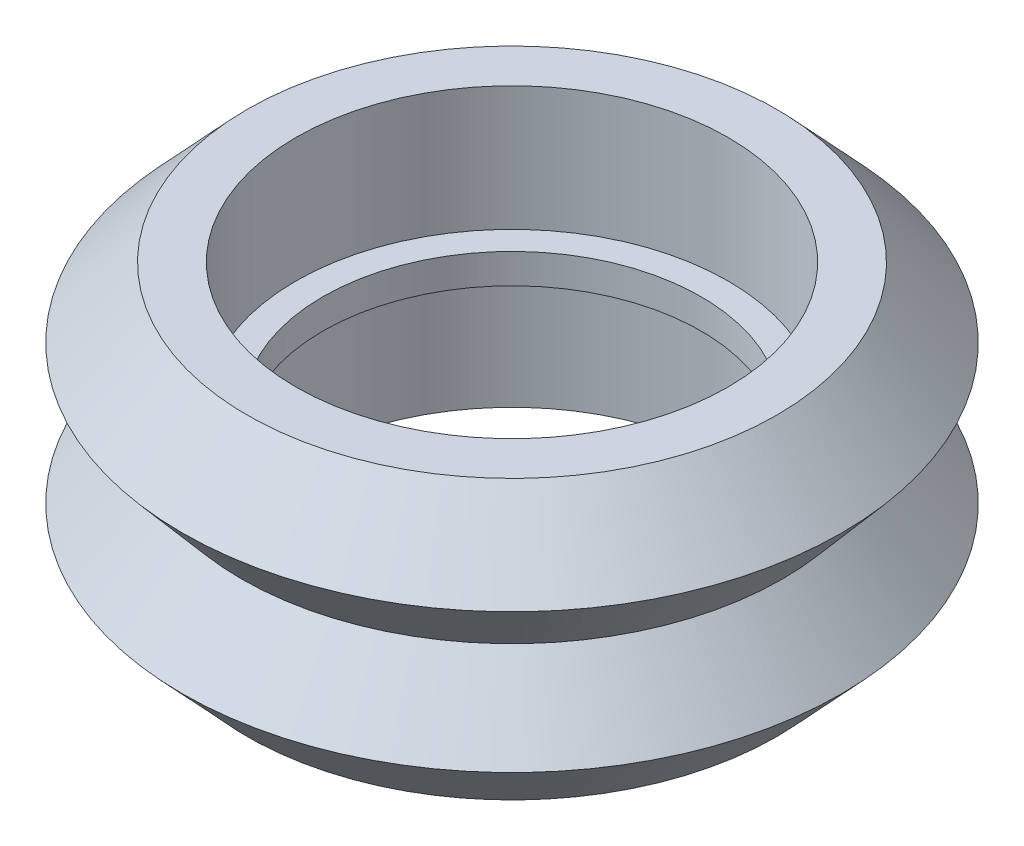
ISO-10303-21;
HEADER;
FILE_DESCRIPTION(('STEP AP214'),'2;1');
FILE_NAME('part.step','',(''),(''),'','','');
FILE_SCHEMA(('AUTOMOTIVE_DESIGN { 1 0 10303 214 1 1 1 1 }'));
ENDSEC;
DATA;
#1=APPLICATION_CONTEXT('core data for automotive mechanical design processes');
#2=APPLICATION_PROTOCOL_DEFINITION('international standard','automotive_design',2000,#1);
#3=PRODUCT_CONTEXT('',#1,'mechanical');
#4=PRODUCT('Part','Part','',(#3));
#5=PRODUCT_RELATED_PRODUCT_CATEGORY('part','',(#4));
#6=PRODUCT_DEFINITION_FORMATION('','',#4);
#7=PRODUCT_DEFINITION_CONTEXT('part definition',#1,'design');
#8=PRODUCT_DEFINITION('design','',#6,#7);
#9=PRODUCT_DEFINITION_SHAPE('','',#8);
#10=(LENGTH_UNIT() NAMED_UNIT(*) SI_UNIT(.MILLI.,.METRE.));
#11=(NAMED_UNIT(*) PLANE_ANGLE_UNIT() SI_UNIT($,.RADIAN.));
#12=(NAMED_UNIT(*) SI_UNIT($,.STERADIAN.) SOLID_ANGLE_UNIT());
#13=UNCERTAINTY_MEASURE_WITH_UNIT(LENGTH_MEASURE(1.E-05),#10,'distance_accuracy_value','');
#14=(GEOMETRIC_REPRESENTATION_CONTEXT(3) GLOBAL_UNCERTAINTY_ASSIGNED_CONTEXT((#13)) GLOBAL_UNIT_ASSIGNED_CONTEXT((#10,
#11,#12)) REPRESENTATION_CONTEXT('',''));
#15=CARTESIAN_POINT('',(0.,0.,0.));
#16=DIRECTION('',(0.,0.,1.));
#17=DIRECTION('',(1.,0.,0.));
#18=AXIS2_PLACEMENT_3D('',#15,#16,#17);
#19=CARTESIAN_POINT('',(6.77329391317618,2.75971763161515,-0.987652433195763));
#20=DIRECTION('',(0.,1.,0.));
#21=DIRECTION('',(1.,0.,0.));
#22=AXIS2_PLACEMENT_3D('',#19,#20,#21);
#23=PLANE('',#22);
#24=CARTESIAN_POINT('',(-1.22170608682382,2.75971763161515,-0.987652433195763));
#25=DIRECTION('',(0.,-1.,0.));
#26=DIRECTION('',(1.,0.,0.));
#27=AXIS2_PLACEMENT_3D('',#24,#25,#26);
#28=CIRCLE('',#27,7.995);
#29=CARTESIAN_POINT('',(6.77329391317618,2.75971763161515,-0.987652433195763));
#30=VERTEX_POINT('',#29);
#31=CARTESIAN_POINT('',(-9.21670608682382,2.75971763161515,-0.987652433195764));
#32=VERTEX_POINT('',#31);
#33=EDGE_CURVE('E39',#30,#32,#28,.T.);
#34=ORIENTED_EDGE('',*,*,#33,.F.);
#35=CARTESIAN_POINT('',(-1.22170608682382,2.75971763161515,-0.987652433195763));
#36=DIRECTION('',(0.,-1.,0.));
#37=DIRECTION('',(1.,0.,0.));
#38=AXIS2_PLACEMENT_3D('',#35,#36,#37);
#39=CIRCLE('',#38,7.995);
#40=EDGE_CURVE('E153',#32,#30,#39,.T.);
#41=ORIENTED_EDGE('',*,*,#40,.F.);
#42=EDGE_LOOP('',(#34,#41));
#43=FACE_BOUND('',#42,.T.);
#44=CARTESIAN_POINT('',(-1.22170608682382,2.75971763161515,-0.987652433195763));
#45=DIRECTION('',(0.,-1.,0.));
#46=DIRECTION('',(1.,0.,0.));
#47=AXIS2_PLACEMENT_3D('',#44,#45,#46);
#48=CIRCLE('',#47,6.995);
#49=CARTESIAN_POINT('',(5.77329391317618,2.75971763161515,-0.987652433195763));
#50=VERTEX_POINT('',#49);
#51=CARTESIAN_POINT('',(-8.21670608682382,2.75971763161515,-0.987652433195763));
#52=VERTEX_POINT('',#51);
#53=EDGE_CURVE('E10',#50,#52,#48,.T.);
#54=ORIENTED_EDGE('',*,*,#53,.T.);
#55=CARTESIAN_POINT('',(-1.22170608682382,2.75971763161515,-0.987652433195763));
#56=DIRECTION('',(0.,-1.,0.));
#57=DIRECTION('',(1.,0.,0.));
#58=AXIS2_PLACEMENT_3D('',#55,#56,#57);
#59=CIRCLE('',#58,6.995);
#60=EDGE_CURVE('E27',#52,#50,#59,.T.);
#61=ORIENTED_EDGE('',*,*,#60,.T.);
#62=EDGE_LOOP('',(#54,#61));
#63=FACE_BOUND('',#62,.T.);
#64=ADVANCED_FACE('F16',(#43,#63),#23,.T.);
#65=CARTESIAN_POINT('',(-1.22170608682382,5.05971763161515,-0.987652433195763));
#66=DIRECTION('',(0.,-1.,0.));
#67=DIRECTION('',(1.,0.,0.));
#68=AXIS2_PLACEMENT_3D('',#65,#66,#67);
#69=CYLINDRICAL_SURFACE('',#68,7.995);
#70=ORIENTED_EDGE('',*,*,#33,.T.);
#71=DIRECTION('',(0.,1.,0.));
#72=VECTOR('',#71,1.);
#73=CARTESIAN_POINT('',(-9.21670608682382,5.05971763161515,-0.987652433195764));
#74=LINE('',#73,#72);
#75=CARTESIAN_POINT('',(-9.21670608682382,7.35971763161515,-0.987652433195764));
#76=VERTEX_POINT('',#75);
#77=EDGE_CURVE('E149',#32,#76,#74,.T.);
#78=ORIENTED_EDGE('',*,*,#77,.T.);
#79=CARTESIAN_POINT('',(-1.22170608682382,7.35971763161515,-0.987652433195763));
#80=DIRECTION('',(0.,-1.,0.));
#81=DIRECTION('',(1.,0.,0.));
#82=AXIS2_PLACEMENT_3D('',#79,#80,#81);
#83=CIRCLE('',#82,7.995);
#84=CARTESIAN_POINT('',(6.77329391317618,7.35971763161515,-0.987652433195763));
#85=VERTEX_POINT('',#84);
#86=EDGE_CURVE('E154',#85,#76,#83,.T.);
#87=ORIENTED_EDGE('',*,*,#86,.F.);
#88=CARTESIAN_POINT('',(-1.22170608682382,7.35971763161515,-0.987652433195763));
#89=DIRECTION('',(0.,-1.,0.));
#90=DIRECTION('',(1.,0.,0.));
#91=AXIS2_PLACEMENT_3D('',#88,#89,#90);
#92=CIRCLE('',#91,7.995);
#93=EDGE_CURVE('E157',#76,#85,#92,.T.);
#94=ORIENTED_EDGE('',*,*,#93,.F.);
#95=ORIENTED_EDGE('',*,*,#77,.F.);
#96=ORIENTED_EDGE('',*,*,#40,.T.);
#97=EDGE_LOOP('',(#70,#78,#87,#94,#95,#96));
#98=FACE_BOUND('',#97,.T.);
#99=ADVANCED_FACE('F163',(#98),#69,.F.);
#100=CARTESIAN_POINT('',(8.57329391317618,7.35971763161515,-0.987652433195763));
#101=DIRECTION('',(0.,1.,0.));
#102=DIRECTION('',(1.,0.,0.));
#103=AXIS2_PLACEMENT_3D('',#100,#101,#102);
#104=PLANE('',#103);
#105=CARTESIAN_POINT('',(-1.22170608682382,7.35971763161515,-0.987652433195763));
#106=DIRECTION('',(0.,-1.,0.));
#107=DIRECTION('',(1.,0.,0.));
#108=AXIS2_PLACEMENT_3D('',#105,#106,#107);
#109=CIRCLE('',#108,9.795);
#110=CARTESIAN_POINT('',(8.57329391317618,7.35971763161515,-0.987652433195763));
#111=VERTEX_POINT('',#110);
#112=CARTESIAN_POINT('',(-11.0167060868238,7.35971763161515,-0.987652433195764));
#113=VERTEX_POINT('',#112);
#114=EDGE_CURVE('E205',#111,#113,#109,.T.);
#115=ORIENTED_EDGE('',*,*,#114,.F.);
#116=CARTESIAN_POINT('',(-1.22170608682382,7.35971763161515,-0.987652433195763));
#117=DIRECTION('',(0.,-1.,0.));
#118=DIRECTION('',(1.,0.,0.));
#119=AXIS2_PLACEMENT_3D('',#116,#117,#118);
#120=CIRCLE('',#119,9.795);
#121=EDGE_CURVE('E20',#113,#111,#120,.T.);
#122=ORIENTED_EDGE('',*,*,#121,.F.);
#123=EDGE_LOOP('',(#115,#122));
#124=FACE_BOUND('',#123,.T.);
#125=ORIENTED_EDGE('',*,*,#86,.T.);
#126=ORIENTED_EDGE('',*,*,#93,.T.);
#127=EDGE_LOOP('',(#125,#126));
#128=FACE_BOUND('',#127,.T.);
#129=ADVANCED_FACE('F275',(#124,#128),#104,.T.);
#130=CARTESIAN_POINT('',(-1.22170608682382,6.07221763161515,-0.987652433195763));
#131=DIRECTION('',(0.,-1.,0.));
#132=DIRECTION('',(1.,0.,0.));
#133=AXIS2_PLACEMENT_3D('',#130,#131,#132);
#134=CONICAL_SURFACE('',#133,10.995,0.75023678144242);
#135=CARTESIAN_POINT('',(-1.22170608682382,4.78471763161515,-0.987652433195763));
#136=DIRECTION('',(0.,-1.,0.));
#137=DIRECTION('',(1.,0.,0.));
#138=AXIS2_PLACEMENT_3D('',#135,#136,#137);
#139=CIRCLE('',#138,12.195);
#140=CARTESIAN_POINT('',(10.9732939131762,4.78471763161515,-0.987652433195763));
#141=VERTEX_POINT('',#140);
#142=CARTESIAN_POINT('',(-13.4167060868238,4.78471763161515,-0.987652433195764));
#143=VERTEX_POINT('',#142);
#144=EDGE_CURVE('E193',#141,#143,#139,.T.);
#145=ORIENTED_EDGE('',*,*,#144,.F.);
#146=CARTESIAN_POINT('',(-1.22170608682382,4.78471763161515,-0.987652433195763));
#147=DIRECTION('',(0.,-1.,0.));
#148=DIRECTION('',(1.,0.,0.));
#149=AXIS2_PLACEMENT_3D('',#146,#147,#148);
#150=CIRCLE('',#149,12.195);
#151=EDGE_CURVE('E194',#143,#141,#150,.T.);
#152=ORIENTED_EDGE('',*,*,#151,.F.);
#153=DIRECTION('',(0.681811991259297,0.731527448955288,0.));
#154=VECTOR('',#153,1.);
#155=CARTESIAN_POINT('',(-12.2167060868238,6.07221763161515,-0.987652433195764));
#156=LINE('',#155,#154);
#157=EDGE_CURVE('E224',#143,#113,#156,.T.);
#158=ORIENTED_EDGE('',*,*,#157,.T.);
#159=ORIENTED_EDGE('',*,*,#121,.T.);
#160=ORIENTED_EDGE('',*,*,#114,.T.);
#161=ORIENTED_EDGE('',*,*,#157,.F.);
#162=EDGE_LOOP('',(#145,#152,#158,#159,#160,#161));
#163=FACE_BOUND('',#162,.T.);
#164=ADVANCED_FACE('F277',(#163),#134,.T.);
#165=CARTESIAN_POINT('',(-1.22170608682382,3.49721763161515,-0.987652433195763));
#166=DIRECTION('',(0.,1.,0.));
#167=DIRECTION('',(1.,0.,0.));
#168=AXIS2_PLACEMENT_3D('',#165,#166,#167);
#169=CONICAL_SURFACE('',#168,11.0975,0.70590148323074);
#170=CARTESIAN_POINT('',(-1.22170608682382,2.20971763161515,-0.987652433195763));
#171=DIRECTION('',(0.,-1.,0.));
#172=DIRECTION('',(1.,0.,0.));
#173=AXIS2_PLACEMENT_3D('',#170,#171,#172);
#174=CIRCLE('',#173,10.);
#175=CARTESIAN_POINT('',(8.77829391317618,2.20971763161515,-0.987652433195763));
#176=VERTEX_POINT('',#175);
#177=CARTESIAN_POINT('',(-11.2217060868238,2.20971763161515,-0.987652433195764));
#178=VERTEX_POINT('',#177);
#179=EDGE_CURVE('E230',#176,#178,#174,.T.);
#180=ORIENTED_EDGE('',*,*,#179,.F.);
#181=CARTESIAN_POINT('',(-1.22170608682382,2.20971763161515,-0.987652433195763));
#182=DIRECTION('',(0.,-1.,0.));
#183=DIRECTION('',(1.,0.,0.));
#184=AXIS2_PLACEMENT_3D('',#181,#182,#183);
#185=CIRCLE('',#184,10.);
#186=EDGE_CURVE('E147',#178,#176,#185,.T.);
#187=ORIENTED_EDGE('',*,*,#186,.F.);
#188=DIRECTION('',(-0.648720146165402,0.761027050740734,0.));
#189=VECTOR('',#188,1.);
#190=CARTESIAN_POINT('',(-12.3192060868238,3.49721763161515,-0.987652433195764));
#191=LINE('',#190,#189);
#192=EDGE_CURVE('E198',#178,#143,#191,.T.);
#193=ORIENTED_EDGE('',*,*,#192,.T.);
#194=ORIENTED_EDGE('',*,*,#151,.T.);
#195=ORIENTED_EDGE('',*,*,#144,.T.);
#196=ORIENTED_EDGE('',*,*,#192,.F.);
#197=EDGE_LOOP('',(#180,#187,#193,#194,#195,#196));
#198=FACE_BOUND('',#197,.T.);
#199=ADVANCED_FACE('F18',(#198),#169,.T.);
#200=CARTESIAN_POINT('',(-1.22170608682382,0.922217631615149,-0.987652433195763));
#201=DIRECTION('',(0.,-1.,0.));
#202=DIRECTION('',(1.,0.,0.));
#203=AXIS2_PLACEMENT_3D('',#200,#201,#202);
#204=CONICAL_SURFACE('',#203,11.0975,0.70590148323074);
#205=CARTESIAN_POINT('',(-1.22170608682382,-0.365282368384851,-0.987652433195763));
#206=DIRECTION('',(0.,-1.,0.));
#207=DIRECTION('',(1.,0.,0.));
#208=AXIS2_PLACEMENT_3D('',#205,#206,#207);
#209=CIRCLE('',#208,12.195);
#210=CARTESIAN_POINT('',(10.9732939131762,-0.365282368384851,-0.987652433195763));
#211=VERTEX_POINT('',#210);
#212=CARTESIAN_POINT('',(-13.4167060868238,-0.365282368384851,-0.987652433195764));
#213=VERTEX_POINT('',#212);
#214=EDGE_CURVE('E131',#211,#213,#209,.T.);
#215=ORIENTED_EDGE('',*,*,#214,.F.);
#216=CARTESIAN_POINT('',(-1.22170608682382,-0.365282368384851,-0.987652433195763));
#217=DIRECTION('',(0.,-1.,0.));
#218=DIRECTION('',(1.,0.,0.));
#219=AXIS2_PLACEMENT_3D('',#216,#217,#218);
#220=CIRCLE('',#219,12.195);
#221=EDGE_CURVE('E211',#213,#211,#220,.T.);
#222=ORIENTED_EDGE('',*,*,#221,.F.);
#223=DIRECTION('',(0.648720146165402,0.761027050740734,0.));
#224=VECTOR('',#223,1.);
#225=CARTESIAN_POINT('',(-12.3192060868238,0.922217631615149,-0.987652433195764));
#226=LINE('',#225,#224);
#227=EDGE_CURVE('E189',#213,#178,#226,.T.);
#228=ORIENTED_EDGE('',*,*,#227,.T.);
#229=ORIENTED_EDGE('',*,*,#186,.T.);
#230=ORIENTED_EDGE('',*,*,#179,.T.);
#231=ORIENTED_EDGE('',*,*,#227,.F.);
#232=EDGE_LOOP('',(#215,#222,#228,#229,#230,#231));
#233=FACE_BOUND('',#232,.T.);
#234=ADVANCED_FACE('F243',(#233),#204,.T.);
#235=CARTESIAN_POINT('',(-1.22170608682382,-1.65278236838485,-0.987652433195763));
#236=DIRECTION('',(0.,1.,0.));
#237=DIRECTION('',(1.,0.,0.));
#238=AXIS2_PLACEMENT_3D('',#235,#236,#237);
#239=CONICAL_SURFACE('',#238,10.995,0.75023678144242);
#240=CARTESIAN_POINT('',(-1.22170608682382,-2.94028236838485,-0.987652433195763));
#241=DIRECTION('',(0.,-1.,0.));
#242=DIRECTION('',(1.,0.,0.));
#243=AXIS2_PLACEMENT_3D('',#240,#241,#242);
#244=CIRCLE('',#243,9.795);
#245=CARTESIAN_POINT('',(8.57329391317618,-2.94028236838485,-0.987652433195763));
#246=VERTEX_POINT('',#245);
#247=CARTESIAN_POINT('',(-11.0167060868238,-2.94028236838485,-0.987652433195764));
#248=VERTEX_POINT('',#247);
#249=EDGE_CURVE('E123',#246,#248,#244,.T.);
#250=ORIENTED_EDGE('',*,*,#249,.F.);
#251=CARTESIAN_POINT('',(-1.22170608682382,-2.94028236838485,-0.987652433195763));
#252=DIRECTION('',(0.,-1.,0.));
#253=DIRECTION('',(1.,0.,0.));
#254=AXIS2_PLACEMENT_3D('',#251,#252,#253);
#255=CIRCLE('',#254,9.795);
#256=EDGE_CURVE('E127',#248,#246,#255,.T.);
#257=ORIENTED_EDGE('',*,*,#256,.F.);
#258=DIRECTION('',(-0.681811991259297,0.731527448955288,0.));
#259=VECTOR('',#258,1.);
#260=CARTESIAN_POINT('',(-12.2167060868238,-1.65278236838485,-0.987652433195764));
#261=LINE('',#260,#259);
#262=EDGE_CURVE('E128',#248,#213,#261,.T.);
#263=ORIENTED_EDGE('',*,*,#262,.T.);
#264=ORIENTED_EDGE('',*,*,#221,.T.);
#265=ORIENTED_EDGE('',*,*,#214,.T.);
#266=ORIENTED_EDGE('',*,*,#262,.F.);
#267=EDGE_LOOP('',(#250,#257,#263,#264,#265,#266));
#268=FACE_BOUND('',#267,.T.);
#269=ADVANCED_FACE('F125',(#268),#239,.T.);
#270=CARTESIAN_POINT('',(6.77329391317618,-2.94028236838485,-0.987652433195763));
#271=DIRECTION('',(0.,-1.,0.));
#272=DIRECTION('',(0.,0.,-1.));
#273=AXIS2_PLACEMENT_3D('',#270,#271,#272);
#274=PLANE('',#273);
#275=ORIENTED_EDGE('',*,*,#249,.T.);
#276=ORIENTED_EDGE('',*,*,#256,.T.);
#277=EDGE_LOOP('',(#275,#276));
#278=FACE_BOUND('',#277,.T.);
#279=CARTESIAN_POINT('',(-1.22170608682382,-2.94028236838485,-0.987652433195763));
#280=DIRECTION('',(0.,-1.,0.));
#281=DIRECTION('',(1.,0.,0.));
#282=AXIS2_PLACEMENT_3D('',#279,#280,#281);
#283=CIRCLE('',#282,7.995);
#284=CARTESIAN_POINT('',(6.77329391317618,-2.94028236838485,-0.987652433195763));
#285=VERTEX_POINT('',#284);
#286=CARTESIAN_POINT('',(-9.21670608682382,-2.94028236838485,-0.987652433195764));
#287=VERTEX_POINT('',#286);
#288=EDGE_CURVE('E136',#285,#287,#283,.T.);
#289=ORIENTED_EDGE('',*,*,#288,.F.);
#290=CARTESIAN_POINT('',(-1.22170608682382,-2.94028236838485,-0.987652433195763));
#291=DIRECTION('',(0.,-1.,0.));
#292=DIRECTION('',(1.,0.,0.));
#293=AXIS2_PLACEMENT_3D('',#290,#291,#292);
#294=CIRCLE('',#293,7.995);
#295=EDGE_CURVE('E201',#287,#285,#294,.T.);
#296=ORIENTED_EDGE('',*,*,#295,.F.);
#297=EDGE_LOOP('',(#289,#296));
#298=FACE_BOUND('',#297,.T.);
#299=ADVANCED_FACE('F133',(#278,#298),#274,.T.);
#300=CARTESIAN_POINT('',(-1.22170608682382,-0.640282368384851,-0.987652433195763));
#301=DIRECTION('',(0.,-1.,0.));
#302=DIRECTION('',(1.,0.,0.));
#303=AXIS2_PLACEMENT_3D('',#300,#301,#302);
#304=CYLINDRICAL_SURFACE('',#303,7.995);
#305=ORIENTED_EDGE('',*,*,#288,.T.);
#306=DIRECTION('',(0.,1.,0.));
#307=VECTOR('',#306,1.);
#308=CARTESIAN_POINT('',(-9.21670608682382,-0.640282368384851,-0.987652433195764));
#309=LINE('',#308,#307);
#310=CARTESIAN_POINT('',(-9.21670608682382,1.65971763161515,-0.987652433195764));
#311=VERTEX_POINT('',#310);
#312=EDGE_CURVE('E143',#287,#311,#309,.T.);
#313=ORIENTED_EDGE('',*,*,#312,.T.);
#314=CARTESIAN_POINT('',(-1.22170608682382,1.65971763161515,-0.987652433195763));
#315=DIRECTION('',(0.,-1.,0.));
#316=DIRECTION('',(1.,0.,0.));
#317=AXIS2_PLACEMENT_3D('',#314,#315,#316);
#318=CIRCLE('',#317,7.995);
#319=CARTESIAN_POINT('',(6.77329391317618,1.65971763161515,-0.987652433195763));
#320=VERTEX_POINT('',#319);
#321=EDGE_CURVE('E199',#320,#311,#318,.T.);
#322=ORIENTED_EDGE('',*,*,#321,.F.);
#323=CARTESIAN_POINT('',(-1.22170608682382,1.65971763161515,-0.987652433195763));
#324=DIRECTION('',(0.,-1.,0.));
#325=DIRECTION('',(1.,0.,0.));
#326=AXIS2_PLACEMENT_3D('',#323,#324,#325);
#327=CIRCLE('',#326,7.995);
#328=EDGE_CURVE('E184',#311,#320,#327,.T.);
#329=ORIENTED_EDGE('',*,*,#328,.F.);
#330=ORIENTED_EDGE('',*,*,#312,.F.);
#331=ORIENTED_EDGE('',*,*,#295,.T.);
#332=EDGE_LOOP('',(#305,#313,#322,#329,#330,#331));
#333=FACE_BOUND('',#332,.T.);
#334=ADVANCED_FACE('F263',(#333),#304,.F.);
#335=CARTESIAN_POINT('',(5.77329391317618,1.65971763161515,-0.987652433195763));
#336=DIRECTION('',(0.,-1.,0.));
#337=DIRECTION('',(0.,0.,-1.));
#338=AXIS2_PLACEMENT_3D('',#335,#336,#337);
#339=PLANE('',#338);
#340=ORIENTED_EDGE('',*,*,#321,.T.);
#341=ORIENTED_EDGE('',*,*,#328,.T.);
#342=EDGE_LOOP('',(#340,#341));
#343=FACE_BOUND('',#342,.T.);
#344=CARTESIAN_POINT('',(-1.22170608682382,1.65971763161515,-0.987652433195763));
#345=DIRECTION('',(0.,-1.,0.));
#346=DIRECTION('',(1.,0.,0.));
#347=AXIS2_PLACEMENT_3D('',#344,#345,#346);
#348=CIRCLE('',#347,6.995);
#349=CARTESIAN_POINT('',(5.77329391317618,1.65971763161515,-0.987652433195763));
#350=VERTEX_POINT('',#349);
#351=CARTESIAN_POINT('',(-8.21670608682382,1.65971763161515,-0.987652433195763));
#352=VERTEX_POINT('',#351);
#353=EDGE_CURVE('E176',#350,#352,#348,.T.);
#354=ORIENTED_EDGE('',*,*,#353,.F.);
#355=CARTESIAN_POINT('',(-1.22170608682382,1.65971763161515,-0.987652433195763));
#356=DIRECTION('',(0.,-1.,0.));
#357=DIRECTION('',(1.,0.,0.));
#358=AXIS2_PLACEMENT_3D('',#355,#356,#357);
#359=CIRCLE('',#358,6.995);
#360=EDGE_CURVE('E178',#352,#350,#359,.T.);
#361=ORIENTED_EDGE('',*,*,#360,.F.);
#362=EDGE_LOOP('',(#354,#361));
#363=FACE_BOUND('',#362,.T.);
#364=ADVANCED_FACE('F259',(#343,#363),#339,.T.);
#365=CARTESIAN_POINT('',(-1.22170608682382,2.20971763161515,-0.987652433195763));
#366=DIRECTION('',(0.,-1.,0.));
#367=DIRECTION('',(1.,0.,0.));
#368=AXIS2_PLACEMENT_3D('',#365,#366,#367);
#369=CYLINDRICAL_SURFACE('',#368,6.995);
#370=ORIENTED_EDGE('',*,*,#353,.T.);
#371=DIRECTION('',(0.,1.,0.));
#372=VECTOR('',#371,1.);
#373=CARTESIAN_POINT('',(-8.21670608682382,2.20971763161515,-0.987652433195763));
#374=LINE('',#373,#372);
#375=EDGE_CURVE('E173',#352,#52,#374,.T.);
#376=ORIENTED_EDGE('',*,*,#375,.T.);
#377=ORIENTED_EDGE('',*,*,#53,.F.);
#378=ORIENTED_EDGE('',*,*,#60,.F.);
#379=ORIENTED_EDGE('',*,*,#375,.F.);
#380=ORIENTED_EDGE('',*,*,#360,.T.);
#381=EDGE_LOOP('',(#370,#376,#377,#378,#379,#380));
#382=FACE_BOUND('',#381,.T.);
#383=ADVANCED_FACE('F174',(#382),#369,.F.);
#384=CLOSED_SHELL('',(#64,#99,#129,#164,#199,#234,#269,#299,#334,#364,#383));
#385=MANIFOLD_SOLID_BREP('B1',#384);
#386=ADVANCED_BREP_SHAPE_REPRESENTATION('',(#18,#385),#14);
#387=SHAPE_DEFINITION_REPRESENTATION(#9,#386);
ENDSEC;
END-ISO-10303-21;
